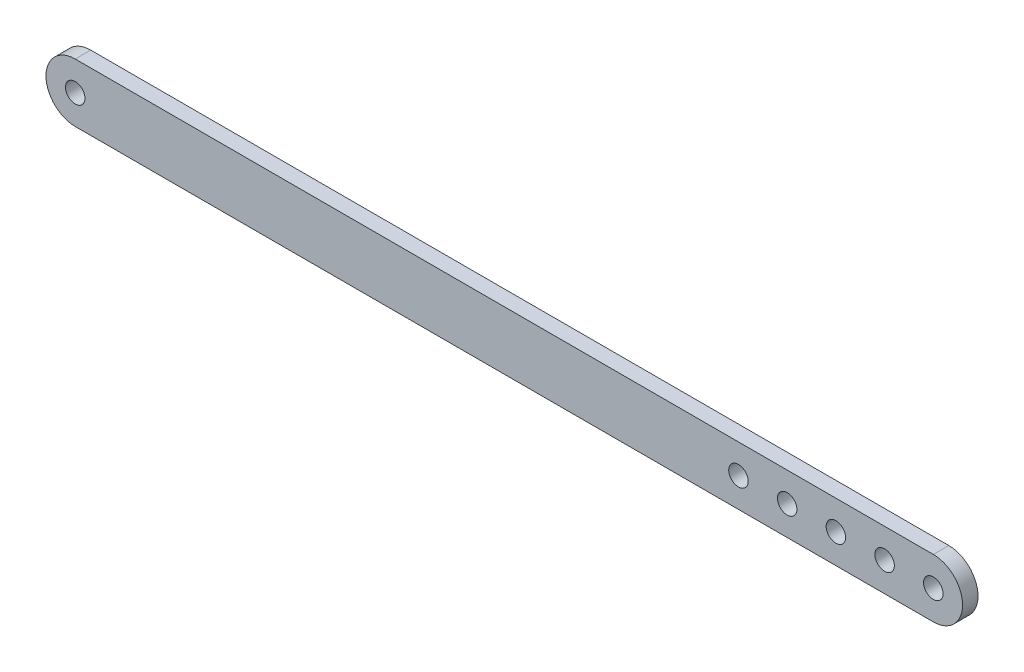
ISO-10303-21;
HEADER;
FILE_DESCRIPTION(('STEP AP214'),'2;1');
FILE_NAME('part.step','',(''),(''),'','','');
FILE_SCHEMA(('AUTOMOTIVE_DESIGN { 1 0 10303 214 1 1 1 1 }'));
ENDSEC;
DATA;
#1=APPLICATION_CONTEXT('core data for automotive mechanical design processes');
#2=APPLICATION_PROTOCOL_DEFINITION('international standard','automotive_design',2000,#1);
#3=PRODUCT_CONTEXT('',#1,'mechanical');
#4=PRODUCT('Part','Part','',(#3));
#5=PRODUCT_RELATED_PRODUCT_CATEGORY('part','',(#4));
#6=PRODUCT_DEFINITION_FORMATION('','',#4);
#7=PRODUCT_DEFINITION_CONTEXT('part definition',#1,'design');
#8=PRODUCT_DEFINITION('design','',#6,#7);
#9=PRODUCT_DEFINITION_SHAPE('','',#8);
#10=(LENGTH_UNIT() NAMED_UNIT(*) SI_UNIT(.MILLI.,.METRE.));
#11=(NAMED_UNIT(*) PLANE_ANGLE_UNIT() SI_UNIT($,.RADIAN.));
#12=(NAMED_UNIT(*) SI_UNIT($,.STERADIAN.) SOLID_ANGLE_UNIT());
#13=UNCERTAINTY_MEASURE_WITH_UNIT(LENGTH_MEASURE(1.E-05),#10,'distance_accuracy_value','');
#14=(GEOMETRIC_REPRESENTATION_CONTEXT(3) GLOBAL_UNCERTAINTY_ASSIGNED_CONTEXT((#13)) GLOBAL_UNIT_ASSIGNED_CONTEXT((#10,
#11,#12)) REPRESENTATION_CONTEXT('',''));
#15=CARTESIAN_POINT('',(0.,0.,0.));
#16=DIRECTION('',(0.,0.,1.));
#17=DIRECTION('',(1.,0.,0.));
#18=AXIS2_PLACEMENT_3D('',#15,#16,#17);
#19=CARTESIAN_POINT('',(0.,0.,3.175));
#20=DIRECTION('',(0.,0.,1.));
#21=DIRECTION('',(1.,0.,0.));
#22=AXIS2_PLACEMENT_3D('',#19,#20,#21);
#23=PLANE('',#22);
#24=CARTESIAN_POINT('',(146.1626,0.,3.175));
#25=DIRECTION('',(0.,0.,1.));
#26=DIRECTION('',(1.,0.,0.));
#27=AXIS2_PLACEMENT_3D('',#24,#25,#26);
#28=CIRCLE('',#27,2.);
#29=CARTESIAN_POINT('',(148.1626,0.,3.175));
#30=VERTEX_POINT('',#29);
#31=EDGE_CURVE('E139',#30,#30,#28,.T.);
#32=ORIENTED_EDGE('',*,*,#31,.F.);
#33=EDGE_LOOP('',(#32));
#34=FACE_BOUND('',#33,.T.);
#35=CARTESIAN_POINT('',(166.1626,0.,3.175));
#36=DIRECTION('',(0.,0.,1.));
#37=DIRECTION('',(1.,0.,0.));
#38=AXIS2_PLACEMENT_3D('',#35,#36,#37);
#39=CIRCLE('',#38,2.);
#40=CARTESIAN_POINT('',(168.1626,0.,3.175));
#41=VERTEX_POINT('',#40);
#42=EDGE_CURVE('E127',#41,#41,#39,.T.);
#43=ORIENTED_EDGE('',*,*,#42,.F.);
#44=EDGE_LOOP('',(#43));
#45=FACE_BOUND('',#44,.T.);
#46=CARTESIAN_POINT('',(0.,0.,3.175));
#47=DIRECTION('',(0.,0.,1.));
#48=DIRECTION('',(1.,0.,0.));
#49=AXIS2_PLACEMENT_3D('',#46,#47,#48);
#50=CIRCLE('',#49,2.);
#51=CARTESIAN_POINT('',(2.,0.,3.175));
#52=VERTEX_POINT('',#51);
#53=EDGE_CURVE('E106',#52,#52,#50,.T.);
#54=ORIENTED_EDGE('',*,*,#53,.F.);
#55=EDGE_LOOP('',(#54));
#56=FACE_BOUND('',#55,.T.);
#57=CARTESIAN_POINT('',(0.,0.,3.175));
#58=DIRECTION('',(0.,0.,1.));
#59=DIRECTION('',(1.,0.,0.));
#60=AXIS2_PLACEMENT_3D('',#57,#58,#59);
#61=CIRCLE('',#60,6.00000000000001);
#62=CARTESIAN_POINT('',(0.,6.,3.175));
#63=VERTEX_POINT('',#62);
#64=CARTESIAN_POINT('',(0.,-6.00000000000002,3.175));
#65=VERTEX_POINT('',#64);
#66=EDGE_CURVE('E91',#63,#65,#61,.T.);
#67=ORIENTED_EDGE('',*,*,#66,.T.);
#68=DIRECTION('',(1.,0.,0.));
#69=VECTOR('',#68,1.);
#70=CARTESIAN_POINT('',(176.1626,-6.,3.175));
#71=LINE('',#70,#69);
#72=CARTESIAN_POINT('',(176.1626,-6.,3.175));
#73=VERTEX_POINT('',#72);
#74=EDGE_CURVE('E86',#65,#73,#71,.T.);
#75=ORIENTED_EDGE('',*,*,#74,.T.);
#76=CARTESIAN_POINT('',(176.1626,0.,3.175));
#77=DIRECTION('',(0.,0.,1.));
#78=DIRECTION('',(-1.,0.,0.));
#79=AXIS2_PLACEMENT_3D('',#76,#77,#78);
#80=CIRCLE('',#79,6.);
#81=CARTESIAN_POINT('',(176.1626,6.,3.175));
#82=VERTEX_POINT('',#81);
#83=EDGE_CURVE('E89',#73,#82,#80,.T.);
#84=ORIENTED_EDGE('',*,*,#83,.T.);
#85=DIRECTION('',(-1.,0.,0.));
#86=VECTOR('',#85,1.);
#87=CARTESIAN_POINT('',(0.,6.,3.175));
#88=LINE('',#87,#86);
#89=EDGE_CURVE('E56',#82,#63,#88,.T.);
#90=ORIENTED_EDGE('',*,*,#89,.T.);
#91=EDGE_LOOP('',(#67,#75,#84,#90));
#92=FACE_BOUND('',#91,.T.);
#93=CARTESIAN_POINT('',(176.1626,0.,3.175));
#94=DIRECTION('',(0.,0.,1.));
#95=DIRECTION('',(1.,0.,0.));
#96=AXIS2_PLACEMENT_3D('',#93,#94,#95);
#97=CIRCLE('',#96,2.);
#98=CARTESIAN_POINT('',(178.1626,0.,3.175));
#99=VERTEX_POINT('',#98);
#100=EDGE_CURVE('E121',#99,#99,#97,.T.);
#101=ORIENTED_EDGE('',*,*,#100,.F.);
#102=EDGE_LOOP('',(#101));
#103=FACE_BOUND('',#102,.T.);
#104=CARTESIAN_POINT('',(156.1626,0.,3.175));
#105=DIRECTION('',(0.,0.,1.));
#106=DIRECTION('',(1.,0.,0.));
#107=AXIS2_PLACEMENT_3D('',#104,#105,#106);
#108=CIRCLE('',#107,2.);
#109=CARTESIAN_POINT('',(158.1626,0.,3.175));
#110=VERTEX_POINT('',#109);
#111=EDGE_CURVE('E133',#110,#110,#108,.T.);
#112=ORIENTED_EDGE('',*,*,#111,.F.);
#113=EDGE_LOOP('',(#112));
#114=FACE_BOUND('',#113,.T.);
#115=CARTESIAN_POINT('',(136.1626,0.,3.175));
#116=DIRECTION('',(0.,0.,1.));
#117=DIRECTION('',(1.,0.,0.));
#118=AXIS2_PLACEMENT_3D('',#115,#116,#117);
#119=CIRCLE('',#118,2.);
#120=CARTESIAN_POINT('',(138.1626,0.,3.175));
#121=VERTEX_POINT('',#120);
#122=EDGE_CURVE('E145',#121,#121,#119,.T.);
#123=ORIENTED_EDGE('',*,*,#122,.F.);
#124=EDGE_LOOP('',(#123));
#125=FACE_BOUND('',#124,.T.);
#126=ADVANCED_FACE('F39',(#34,#45,#56,#92,#103,#114,#125),#23,.T.);
#127=CARTESIAN_POINT('',(0.,0.,0.));
#128=DIRECTION('',(0.,0.,1.));
#129=DIRECTION('',(1.,0.,0.));
#130=AXIS2_PLACEMENT_3D('',#127,#128,#129);
#131=PLANE('',#130);
#132=CARTESIAN_POINT('',(0.,0.,0.));
#133=DIRECTION('',(0.,0.,1.));
#134=DIRECTION('',(1.,0.,0.));
#135=AXIS2_PLACEMENT_3D('',#132,#133,#134);
#136=CIRCLE('',#135,6.00000000000001);
#137=CARTESIAN_POINT('',(0.,6.,0.));
#138=VERTEX_POINT('',#137);
#139=CARTESIAN_POINT('',(0.,-6.00000000000002,0.));
#140=VERTEX_POINT('',#139);
#141=EDGE_CURVE('E103',#138,#140,#136,.T.);
#142=ORIENTED_EDGE('',*,*,#141,.F.);
#143=DIRECTION('',(-1.,0.,0.));
#144=VECTOR('',#143,1.);
#145=CARTESIAN_POINT('',(0.,6.,0.));
#146=LINE('',#145,#144);
#147=CARTESIAN_POINT('',(176.1626,6.,0.));
#148=VERTEX_POINT('',#147);
#149=EDGE_CURVE('E79',#148,#138,#146,.T.);
#150=ORIENTED_EDGE('',*,*,#149,.F.);
#151=CARTESIAN_POINT('',(176.1626,0.,0.));
#152=DIRECTION('',(0.,0.,1.));
#153=DIRECTION('',(-1.,0.,0.));
#154=AXIS2_PLACEMENT_3D('',#151,#152,#153);
#155=CIRCLE('',#154,6.);
#156=CARTESIAN_POINT('',(176.1626,-6.,0.));
#157=VERTEX_POINT('',#156);
#158=EDGE_CURVE('E73',#157,#148,#155,.T.);
#159=ORIENTED_EDGE('',*,*,#158,.F.);
#160=DIRECTION('',(1.,0.,0.));
#161=VECTOR('',#160,1.);
#162=CARTESIAN_POINT('',(176.1626,-6.,0.));
#163=LINE('',#162,#161);
#164=EDGE_CURVE('E95',#140,#157,#163,.T.);
#165=ORIENTED_EDGE('',*,*,#164,.F.);
#166=EDGE_LOOP('',(#142,#150,#159,#165));
#167=FACE_BOUND('',#166,.T.);
#168=CARTESIAN_POINT('',(0.,0.,0.));
#169=DIRECTION('',(0.,0.,1.));
#170=DIRECTION('',(1.,0.,0.));
#171=AXIS2_PLACEMENT_3D('',#168,#169,#170);
#172=CIRCLE('',#171,2.);
#173=CARTESIAN_POINT('',(2.,0.,0.));
#174=VERTEX_POINT('',#173);
#175=EDGE_CURVE('E118',#174,#174,#172,.T.);
#176=ORIENTED_EDGE('',*,*,#175,.T.);
#177=EDGE_LOOP('',(#176));
#178=FACE_BOUND('',#177,.T.);
#179=CARTESIAN_POINT('',(176.1626,0.,0.));
#180=DIRECTION('',(0.,0.,1.));
#181=DIRECTION('',(1.,0.,0.));
#182=AXIS2_PLACEMENT_3D('',#179,#180,#181);
#183=CIRCLE('',#182,2.);
#184=CARTESIAN_POINT('',(178.1626,0.,0.));
#185=VERTEX_POINT('',#184);
#186=EDGE_CURVE('E124',#185,#185,#183,.T.);
#187=ORIENTED_EDGE('',*,*,#186,.T.);
#188=EDGE_LOOP('',(#187));
#189=FACE_BOUND('',#188,.T.);
#190=CARTESIAN_POINT('',(166.1626,0.,0.));
#191=DIRECTION('',(0.,0.,1.));
#192=DIRECTION('',(1.,0.,0.));
#193=AXIS2_PLACEMENT_3D('',#190,#191,#192);
#194=CIRCLE('',#193,2.);
#195=CARTESIAN_POINT('',(168.1626,0.,0.));
#196=VERTEX_POINT('',#195);
#197=EDGE_CURVE('E130',#196,#196,#194,.T.);
#198=ORIENTED_EDGE('',*,*,#197,.T.);
#199=EDGE_LOOP('',(#198));
#200=FACE_BOUND('',#199,.T.);
#201=CARTESIAN_POINT('',(156.1626,0.,0.));
#202=DIRECTION('',(0.,0.,1.));
#203=DIRECTION('',(1.,0.,0.));
#204=AXIS2_PLACEMENT_3D('',#201,#202,#203);
#205=CIRCLE('',#204,2.);
#206=CARTESIAN_POINT('',(158.1626,0.,0.));
#207=VERTEX_POINT('',#206);
#208=EDGE_CURVE('E136',#207,#207,#205,.T.);
#209=ORIENTED_EDGE('',*,*,#208,.T.);
#210=EDGE_LOOP('',(#209));
#211=FACE_BOUND('',#210,.T.);
#212=CARTESIAN_POINT('',(146.1626,0.,0.));
#213=DIRECTION('',(0.,0.,1.));
#214=DIRECTION('',(1.,0.,0.));
#215=AXIS2_PLACEMENT_3D('',#212,#213,#214);
#216=CIRCLE('',#215,2.);
#217=CARTESIAN_POINT('',(148.1626,0.,0.));
#218=VERTEX_POINT('',#217);
#219=EDGE_CURVE('E142',#218,#218,#216,.T.);
#220=ORIENTED_EDGE('',*,*,#219,.T.);
#221=EDGE_LOOP('',(#220));
#222=FACE_BOUND('',#221,.T.);
#223=CARTESIAN_POINT('',(136.1626,0.,0.));
#224=DIRECTION('',(0.,0.,1.));
#225=DIRECTION('',(1.,0.,0.));
#226=AXIS2_PLACEMENT_3D('',#223,#224,#225);
#227=CIRCLE('',#226,2.);
#228=CARTESIAN_POINT('',(138.1626,0.,0.));
#229=VERTEX_POINT('',#228);
#230=EDGE_CURVE('E148',#229,#229,#227,.T.);
#231=ORIENTED_EDGE('',*,*,#230,.T.);
#232=EDGE_LOOP('',(#231));
#233=FACE_BOUND('',#232,.T.);
#234=ADVANCED_FACE('F114',(#167,#178,#189,#200,#211,#222,#233),#131,.F.);
#235=CARTESIAN_POINT('',(0.,0.,3.175));
#236=DIRECTION('',(0.,0.,-1.));
#237=DIRECTION('',(-1.,0.,0.));
#238=AXIS2_PLACEMENT_3D('',#235,#236,#237);
#239=CYLINDRICAL_SURFACE('',#238,6.00000000000001);
#240=ORIENTED_EDGE('',*,*,#141,.T.);
#241=DIRECTION('',(0.,0.,-1.));
#242=VECTOR('',#241,1.);
#243=CARTESIAN_POINT('',(0.,-6.00000000000002,3.175));
#244=LINE('',#243,#242);
#245=EDGE_CURVE('E11',#65,#140,#244,.T.);
#246=ORIENTED_EDGE('',*,*,#245,.F.);
#247=ORIENTED_EDGE('',*,*,#66,.F.);
#248=DIRECTION('',(0.,0.,-1.));
#249=VECTOR('',#248,1.);
#250=CARTESIAN_POINT('',(0.,6.,3.175));
#251=LINE('',#250,#249);
#252=EDGE_CURVE('E99',#63,#138,#251,.T.);
#253=ORIENTED_EDGE('',*,*,#252,.T.);
#254=EDGE_LOOP('',(#240,#246,#247,#253));
#255=FACE_BOUND('',#254,.T.);
#256=ADVANCED_FACE('F41',(#255),#239,.T.);
#257=CARTESIAN_POINT('',(176.1626,-6.,3.175));
#258=DIRECTION('',(0.,1.,0.));
#259=DIRECTION('',(-1.,0.,0.));
#260=AXIS2_PLACEMENT_3D('',#257,#258,#259);
#261=PLANE('',#260);
#262=ORIENTED_EDGE('',*,*,#164,.T.);
#263=DIRECTION('',(0.,0.,-1.));
#264=VECTOR('',#263,1.);
#265=CARTESIAN_POINT('',(176.1626,-6.,3.175));
#266=LINE('',#265,#264);
#267=EDGE_CURVE('E48',#73,#157,#266,.T.);
#268=ORIENTED_EDGE('',*,*,#267,.F.);
#269=ORIENTED_EDGE('',*,*,#74,.F.);
#270=ORIENTED_EDGE('',*,*,#245,.T.);
#271=EDGE_LOOP('',(#262,#268,#269,#270));
#272=FACE_BOUND('',#271,.T.);
#273=ADVANCED_FACE('F94',(#272),#261,.F.);
#274=CARTESIAN_POINT('',(176.1626,0.,3.175));
#275=DIRECTION('',(0.,0.,-1.));
#276=DIRECTION('',(-1.,0.,0.));
#277=AXIS2_PLACEMENT_3D('',#274,#275,#276);
#278=CYLINDRICAL_SURFACE('',#277,6.);
#279=ORIENTED_EDGE('',*,*,#158,.T.);
#280=DIRECTION('',(0.,0.,-1.));
#281=VECTOR('',#280,1.);
#282=CARTESIAN_POINT('',(176.1626,6.,3.175));
#283=LINE('',#282,#281);
#284=EDGE_CURVE('E96',#82,#148,#283,.T.);
#285=ORIENTED_EDGE('',*,*,#284,.F.);
#286=ORIENTED_EDGE('',*,*,#83,.F.);
#287=ORIENTED_EDGE('',*,*,#267,.T.);
#288=EDGE_LOOP('',(#279,#285,#286,#287));
#289=FACE_BOUND('',#288,.T.);
#290=ADVANCED_FACE('F97',(#289),#278,.T.);
#291=CARTESIAN_POINT('',(0.,6.,3.175));
#292=DIRECTION('',(0.,-1.,0.));
#293=DIRECTION('',(0.,0.,-1.));
#294=AXIS2_PLACEMENT_3D('',#291,#292,#293);
#295=PLANE('',#294);
#296=ORIENTED_EDGE('',*,*,#149,.T.);
#297=ORIENTED_EDGE('',*,*,#252,.F.);
#298=ORIENTED_EDGE('',*,*,#89,.F.);
#299=ORIENTED_EDGE('',*,*,#284,.T.);
#300=EDGE_LOOP('',(#296,#297,#298,#299));
#301=FACE_BOUND('',#300,.T.);
#302=ADVANCED_FACE('F111',(#301),#295,.F.);
#303=CARTESIAN_POINT('',(0.,0.,3.175));
#304=DIRECTION('',(0.,0.,-1.));
#305=DIRECTION('',(-1.,0.,0.));
#306=AXIS2_PLACEMENT_3D('',#303,#304,#305);
#307=CYLINDRICAL_SURFACE('',#306,2.);
#308=ORIENTED_EDGE('',*,*,#53,.T.);
#309=EDGE_LOOP('',(#308));
#310=FACE_BOUND('',#309,.T.);
#311=ORIENTED_EDGE('',*,*,#175,.F.);
#312=EDGE_LOOP('',(#311));
#313=FACE_BOUND('',#312,.T.);
#314=ADVANCED_FACE('F167',(#310,#313),#307,.F.);
#315=CARTESIAN_POINT('',(176.1626,0.,3.175));
#316=DIRECTION('',(0.,0.,-1.));
#317=DIRECTION('',(-1.,0.,0.));
#318=AXIS2_PLACEMENT_3D('',#315,#316,#317);
#319=CYLINDRICAL_SURFACE('',#318,2.);
#320=ORIENTED_EDGE('',*,*,#100,.T.);
#321=EDGE_LOOP('',(#320));
#322=FACE_BOUND('',#321,.T.);
#323=ORIENTED_EDGE('',*,*,#186,.F.);
#324=EDGE_LOOP('',(#323));
#325=FACE_BOUND('',#324,.T.);
#326=ADVANCED_FACE('F212',(#322,#325),#319,.F.);
#327=CARTESIAN_POINT('',(166.1626,0.,3.175));
#328=DIRECTION('',(0.,0.,-1.));
#329=DIRECTION('',(-1.,0.,0.));
#330=AXIS2_PLACEMENT_3D('',#327,#328,#329);
#331=CYLINDRICAL_SURFACE('',#330,2.);
#332=ORIENTED_EDGE('',*,*,#42,.T.);
#333=EDGE_LOOP('',(#332));
#334=FACE_BOUND('',#333,.T.);
#335=ORIENTED_EDGE('',*,*,#197,.F.);
#336=EDGE_LOOP('',(#335));
#337=FACE_BOUND('',#336,.T.);
#338=ADVANCED_FACE('F220',(#334,#337),#331,.F.);
#339=CARTESIAN_POINT('',(156.1626,0.,3.175));
#340=DIRECTION('',(0.,0.,-1.));
#341=DIRECTION('',(-1.,0.,0.));
#342=AXIS2_PLACEMENT_3D('',#339,#340,#341);
#343=CYLINDRICAL_SURFACE('',#342,2.);
#344=ORIENTED_EDGE('',*,*,#111,.T.);
#345=EDGE_LOOP('',(#344));
#346=FACE_BOUND('',#345,.T.);
#347=ORIENTED_EDGE('',*,*,#208,.F.);
#348=EDGE_LOOP('',(#347));
#349=FACE_BOUND('',#348,.T.);
#350=ADVANCED_FACE('F228',(#346,#349),#343,.F.);
#351=CARTESIAN_POINT('',(146.1626,0.,3.175));
#352=DIRECTION('',(0.,0.,-1.));
#353=DIRECTION('',(-1.,0.,0.));
#354=AXIS2_PLACEMENT_3D('',#351,#352,#353);
#355=CYLINDRICAL_SURFACE('',#354,2.);
#356=ORIENTED_EDGE('',*,*,#31,.T.);
#357=EDGE_LOOP('',(#356));
#358=FACE_BOUND('',#357,.T.);
#359=ORIENTED_EDGE('',*,*,#219,.F.);
#360=EDGE_LOOP('',(#359));
#361=FACE_BOUND('',#360,.T.);
#362=ADVANCED_FACE('F237',(#358,#361),#355,.F.);
#363=CARTESIAN_POINT('',(136.1626,0.,3.175));
#364=DIRECTION('',(0.,0.,-1.));
#365=DIRECTION('',(-1.,0.,0.));
#366=AXIS2_PLACEMENT_3D('',#363,#364,#365);
#367=CYLINDRICAL_SURFACE('',#366,2.);
#368=ORIENTED_EDGE('',*,*,#122,.T.);
#369=EDGE_LOOP('',(#368));
#370=FACE_BOUND('',#369,.T.);
#371=ORIENTED_EDGE('',*,*,#230,.F.);
#372=EDGE_LOOP('',(#371));
#373=FACE_BOUND('',#372,.T.);
#374=ADVANCED_FACE('F154',(#370,#373),#367,.F.);
#375=CLOSED_SHELL('',(#126,#234,#256,#273,#290,#302,#314,#326,#338,#350,#362,#374));
#376=MANIFOLD_SOLID_BREP('B2',#375);
#377=ADVANCED_BREP_SHAPE_REPRESENTATION('',(#18,#376),#14);
#378=SHAPE_DEFINITION_REPRESENTATION(#9,#377);
ENDSEC;
END-ISO-10303-21;
